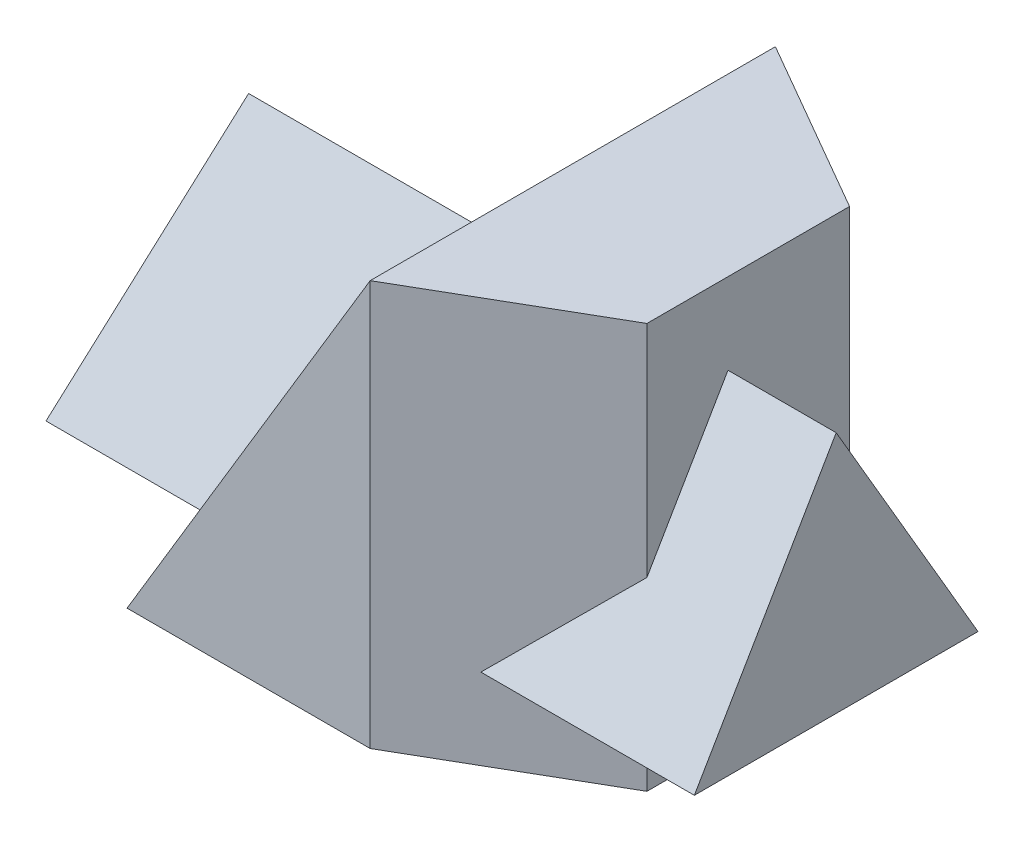
ISO-10303-21;
HEADER;
FILE_DESCRIPTION(('STEP AP214'),'2;1');
FILE_NAME('part.step','',(''),(''),'','','');
FILE_SCHEMA(('AUTOMOTIVE_DESIGN { 1 0 10303 214 1 1 1 1 }'));
ENDSEC;
DATA;
#1=APPLICATION_CONTEXT('core data for automotive mechanical design processes');
#2=APPLICATION_PROTOCOL_DEFINITION('international standard','automotive_design',2000,#1);
#3=PRODUCT_CONTEXT('',#1,'mechanical');
#4=PRODUCT('Part','Part','',(#3));
#5=PRODUCT_RELATED_PRODUCT_CATEGORY('part','',(#4));
#6=PRODUCT_DEFINITION_FORMATION('','',#4);
#7=PRODUCT_DEFINITION_CONTEXT('part definition',#1,'design');
#8=PRODUCT_DEFINITION('design','',#6,#7);
#9=PRODUCT_DEFINITION_SHAPE('','',#8);
#10=(LENGTH_UNIT() NAMED_UNIT(*) SI_UNIT(.MILLI.,.METRE.));
#11=(NAMED_UNIT(*) PLANE_ANGLE_UNIT() SI_UNIT($,.RADIAN.));
#12=(NAMED_UNIT(*) SI_UNIT($,.STERADIAN.) SOLID_ANGLE_UNIT());
#13=UNCERTAINTY_MEASURE_WITH_UNIT(LENGTH_MEASURE(1.E-05),#10,'distance_accuracy_value','');
#14=(GEOMETRIC_REPRESENTATION_CONTEXT(3) GLOBAL_UNCERTAINTY_ASSIGNED_CONTEXT((#13)) GLOBAL_UNIT_ASSIGNED_CONTEXT((#10,
#11,#12)) REPRESENTATION_CONTEXT('',''));
#15=CARTESIAN_POINT('',(0.,0.,0.));
#16=DIRECTION('',(0.,0.,1.));
#17=DIRECTION('',(1.,0.,0.));
#18=AXIS2_PLACEMENT_3D('',#15,#16,#17);
#19=CARTESIAN_POINT('',(60.,100.,0.));
#20=DIRECTION('',(-0.499999999999998,0.,-0.86602540378444));
#21=DIRECTION('',(-0.86602540378444,0.,0.499999999999998));
#22=AXIS2_PLACEMENT_3D('',#19,#20,#21);
#23=PLANE('',#22);
#24=DIRECTION('',(-0.657535505639409,-0.650791373455967,0.379628301182648));
#25=VECTOR('',#24,1.);
#26=CARTESIAN_POINT('',(101.569219381653,43.9999999999998,-23.9999999999999));
#27=LINE('',#26,#25);
#28=CARTESIAN_POINT('',(103.301270189222,45.7142857142855,-24.9999999999999));
#29=VERTEX_POINT('',#28);
#30=CARTESIAN_POINT('',(77.3205080756888,20.,-9.99999999999999));
#31=VERTEX_POINT('',#30);
#32=EDGE_CURVE('E180',#29,#31,#27,.T.);
#33=ORIENTED_EDGE('',*,*,#32,.F.);
#34=DIRECTION('',(0.,-1.,0.));
#35=VECTOR('',#34,1.);
#36=CARTESIAN_POINT('',(103.301270189222,100.,-24.9999999999999));
#37=LINE('',#36,#35);
#38=CARTESIAN_POINT('',(103.301270189222,100.,-24.9999999999999));
#39=VERTEX_POINT('',#38);
#40=EDGE_CURVE('E219',#39,#29,#37,.T.);
#41=ORIENTED_EDGE('',*,*,#40,.F.);
#42=DIRECTION('',(0.86602540378444,0.,-0.499999999999998));
#43=VECTOR('',#42,1.);
#44=CARTESIAN_POINT('',(60.,100.,0.));
#45=LINE('',#44,#43);
#46=CARTESIAN_POINT('',(60.,100.,0.));
#47=VERTEX_POINT('',#46);
#48=EDGE_CURVE('E191',#47,#39,#45,.T.);
#49=ORIENTED_EDGE('',*,*,#48,.F.);
#50=DIRECTION('',(0.,-1.,0.));
#51=VECTOR('',#50,1.);
#52=CARTESIAN_POINT('',(60.,100.,0.));
#53=LINE('',#52,#51);
#54=CARTESIAN_POINT('',(60.,0.,0.));
#55=VERTEX_POINT('',#54);
#56=EDGE_CURVE('E221',#47,#55,#53,.T.);
#57=ORIENTED_EDGE('',*,*,#56,.T.);
#58=DIRECTION('',(0.86602540378444,0.,-0.499999999999998));
#59=VECTOR('',#58,1.);
#60=CARTESIAN_POINT('',(60.,0.,0.));
#61=LINE('',#60,#59);
#62=CARTESIAN_POINT('',(103.301270189222,0.,-24.9999999999999));
#63=VERTEX_POINT('',#62);
#64=EDGE_CURVE('E203',#55,#63,#61,.T.);
#65=ORIENTED_EDGE('',*,*,#64,.T.);
#66=CARTESIAN_POINT('',(103.301270189222,20.,-24.9999999999999));
#67=VERTEX_POINT('',#66);
#68=EDGE_CURVE('E218',#67,#63,#37,.T.);
#69=ORIENTED_EDGE('',*,*,#68,.F.);
#70=DIRECTION('',(0.86602540378444,0.,-0.499999999999998));
#71=VECTOR('',#70,1.);
#72=CARTESIAN_POINT('',(60.,20.,0.));
#73=LINE('',#72,#71);
#74=EDGE_CURVE('E46',#31,#67,#73,.T.);
#75=ORIENTED_EDGE('',*,*,#74,.F.);
#76=EDGE_LOOP('',(#33,#41,#49,#57,#65,#69,#75));
#77=FACE_BOUND('',#76,.T.);
#78=ADVANCED_FACE('F31',(#77),#23,.F.);
#79=CARTESIAN_POINT('',(103.301270189222,100.,-24.9999999999999));
#80=DIRECTION('',(-1.,0.,0.));
#81=DIRECTION('',(0.,0.,1.));
#82=AXIS2_PLACEMENT_3D('',#79,#80,#81);
#83=PLANE('',#82);
#84=DIRECTION('',(0.,0.,-1.));
#85=VECTOR('',#84,1.);
#86=CARTESIAN_POINT('',(103.301270189222,20.,-24.9999999999999));
#87=LINE('',#86,#85);
#88=CARTESIAN_POINT('',(103.301270189222,20.,-75.0000000000001));
#89=VERTEX_POINT('',#88);
#90=EDGE_CURVE('E175',#67,#89,#87,.T.);
#91=ORIENTED_EDGE('',*,*,#90,.F.);
#92=ORIENTED_EDGE('',*,*,#68,.T.);
#93=DIRECTION('',(0.,0.,-1.));
#94=VECTOR('',#93,1.);
#95=CARTESIAN_POINT('',(103.301270189222,0.,-24.9999999999999));
#96=LINE('',#95,#94);
#97=CARTESIAN_POINT('',(103.301270189222,0.,-75.0000000000001));
#98=VERTEX_POINT('',#97);
#99=EDGE_CURVE('E206',#63,#98,#96,.T.);
#100=ORIENTED_EDGE('',*,*,#99,.T.);
#101=DIRECTION('',(0.,-1.,0.));
#102=VECTOR('',#101,1.);
#103=CARTESIAN_POINT('',(103.301270189222,100.,-75.0000000000001));
#104=LINE('',#103,#102);
#105=EDGE_CURVE('E215',#89,#98,#104,.T.);
#106=ORIENTED_EDGE('',*,*,#105,.F.);
#107=EDGE_LOOP('',(#91,#92,#100,#106));
#108=FACE_BOUND('',#107,.T.);
#109=ADVANCED_FACE('F245',(#108),#83,.F.);
#110=DIRECTION('',(0.,-0.863778900898434,0.503871025524086));
#111=VECTOR('',#110,1.);
#112=CARTESIAN_POINT('',(103.301270189222,86.2176165803108,-48.6269430051813));
#113=LINE('',#112,#111);
#114=CARTESIAN_POINT('',(103.301270189222,80.,-45.));
#115=VERTEX_POINT('',#114);
#116=EDGE_CURVE('E54',#115,#29,#113,.T.);
#117=ORIENTED_EDGE('',*,*,#116,.F.);
#118=DIRECTION('',(0.,0.863778900898433,0.503871025524086));
#119=VECTOR('',#118,1.);
#120=CARTESIAN_POINT('',(103.301270189222,103.626943005181,-31.2176165803109));
#121=LINE('',#120,#119);
#122=CARTESIAN_POINT('',(103.301270189222,28.5714285714284,-75.0000000000001));
#123=VERTEX_POINT('',#122);
#124=EDGE_CURVE('E170',#123,#115,#121,.T.);
#125=ORIENTED_EDGE('',*,*,#124,.F.);
#126=CARTESIAN_POINT('',(103.301270189222,100.,-75.0000000000001));
#127=VERTEX_POINT('',#126);
#128=EDGE_CURVE('E216',#127,#123,#104,.T.);
#129=ORIENTED_EDGE('',*,*,#128,.F.);
#130=DIRECTION('',(0.,0.,-1.));
#131=VECTOR('',#130,1.);
#132=CARTESIAN_POINT('',(103.301270189222,100.,-24.9999999999999));
#133=LINE('',#132,#131);
#134=EDGE_CURVE('E193',#39,#127,#133,.T.);
#135=ORIENTED_EDGE('',*,*,#134,.F.);
#136=ORIENTED_EDGE('',*,*,#40,.T.);
#137=EDGE_LOOP('',(#117,#125,#129,#135,#136));
#138=FACE_BOUND('',#137,.T.);
#139=ADVANCED_FACE('F267',(#138),#83,.F.);
#140=CARTESIAN_POINT('',(103.301270189222,100.,-75.0000000000001));
#141=DIRECTION('',(-0.499999999999998,0.,0.86602540378444));
#142=DIRECTION('',(0.86602540378444,0.,0.499999999999998));
#143=AXIS2_PLACEMENT_3D('',#140,#141,#142);
#144=PLANE('',#143);
#145=DIRECTION('',(-0.86602540378444,0.,-0.499999999999998));
#146=VECTOR('',#145,1.);
#147=CARTESIAN_POINT('',(103.301270189222,20.,-75.0000000000001));
#148=LINE('',#147,#146);
#149=CARTESIAN_POINT('',(94.6410161513777,20.,-80.));
#150=VERTEX_POINT('',#149);
#151=EDGE_CURVE('E172',#89,#150,#148,.T.);
#152=ORIENTED_EDGE('',*,*,#151,.F.);
#153=ORIENTED_EDGE('',*,*,#105,.T.);
#154=DIRECTION('',(-0.86602540378444,0.,-0.499999999999998));
#155=VECTOR('',#154,1.);
#156=CARTESIAN_POINT('',(103.301270189222,0.,-75.0000000000001));
#157=LINE('',#156,#155);
#158=CARTESIAN_POINT('',(60.,0.,-100.));
#159=VERTEX_POINT('',#158);
#160=EDGE_CURVE('E209',#98,#159,#157,.T.);
#161=ORIENTED_EDGE('',*,*,#160,.T.);
#162=DIRECTION('',(0.,-1.,0.));
#163=VECTOR('',#162,1.);
#164=CARTESIAN_POINT('',(60.,100.,-100.));
#165=LINE('',#164,#163);
#166=CARTESIAN_POINT('',(60.,100.,-100.));
#167=VERTEX_POINT('',#166);
#168=EDGE_CURVE('E199',#167,#159,#165,.T.);
#169=ORIENTED_EDGE('',*,*,#168,.F.);
#170=DIRECTION('',(-0.86602540378444,0.,-0.499999999999998));
#171=VECTOR('',#170,1.);
#172=CARTESIAN_POINT('',(103.301270189222,100.,-75.0000000000001));
#173=LINE('',#172,#171);
#174=EDGE_CURVE('E196',#127,#167,#173,.T.);
#175=ORIENTED_EDGE('',*,*,#174,.F.);
#176=ORIENTED_EDGE('',*,*,#128,.T.);
#177=DIRECTION('',(0.657535505639409,0.650791373455967,0.379628301182647));
#178=VECTOR('',#177,1.);
#179=CARTESIAN_POINT('',(133.866872675732,58.8235294117644,-57.3529411764708));
#180=LINE('',#179,#178);
#181=EDGE_CURVE('E167',#150,#123,#180,.T.);
#182=ORIENTED_EDGE('',*,*,#181,.F.);
#183=EDGE_LOOP('',(#152,#153,#161,#169,#175,#176,#182));
#184=FACE_BOUND('',#183,.T.);
#185=ADVANCED_FACE('F258',(#184),#144,.F.);
#186=CARTESIAN_POINT('',(60.,100.,-100.));
#187=DIRECTION('',(0.857492925712544,-0.514495755427526,0.));
#188=DIRECTION('',(0.514495755427526,0.857492925712544,0.));
#189=AXIS2_PLACEMENT_3D('',#186,#187,#188);
#190=PLANE('',#189);
#191=DIRECTION('',(0.514495755427526,0.857492925712544,0.));
#192=VECTOR('',#191,1.);
#193=CARTESIAN_POINT('',(60.,100.,0.));
#194=LINE('',#193,#192);
#195=CARTESIAN_POINT('',(0.,0.,0.));
#196=VERTEX_POINT('',#195);
#197=EDGE_CURVE('E182',#196,#47,#194,.T.);
#198=ORIENTED_EDGE('',*,*,#197,.T.);
#199=DIRECTION('',(0.,0.,1.));
#200=VECTOR('',#199,1.);
#201=CARTESIAN_POINT('',(60.,100.,-100.));
#202=LINE('',#201,#200);
#203=EDGE_CURVE('E186',#167,#47,#202,.T.);
#204=ORIENTED_EDGE('',*,*,#203,.F.);
#205=DIRECTION('',(0.514495755427526,0.857492925712544,0.));
#206=VECTOR('',#205,1.);
#207=CARTESIAN_POINT('',(60.,100.,-100.));
#208=LINE('',#207,#206);
#209=CARTESIAN_POINT('',(0.,0.,-100.));
#210=VERTEX_POINT('',#209);
#211=EDGE_CURVE('E183',#210,#167,#208,.T.);
#212=ORIENTED_EDGE('',*,*,#211,.F.);
#213=DIRECTION('',(0.,0.,1.));
#214=VECTOR('',#213,1.);
#215=CARTESIAN_POINT('',(0.,0.,0.));
#216=LINE('',#215,#214);
#217=EDGE_CURVE('E190',#210,#196,#216,.T.);
#218=ORIENTED_EDGE('',*,*,#217,.T.);
#219=EDGE_LOOP('',(#198,#204,#212,#218));
#220=FACE_BOUND('',#219,.T.);
#221=DIRECTION('',(0.460141401592205,0.766902335987008,-0.447359695992421));
#222=VECTOR('',#221,1.);
#223=CARTESIAN_POINT('',(68.9201110929587,114.866851821598,-65.338996895932));
#224=LINE('',#223,#222);
#225=CARTESIAN_POINT('',(12.,20.,-9.99999999999999));
#226=VERTEX_POINT('',#225);
#227=CARTESIAN_POINT('',(48.,80.,-45.));
#228=VERTEX_POINT('',#227);
#229=EDGE_CURVE('E39',#226,#228,#224,.T.);
#230=ORIENTED_EDGE('',*,*,#229,.F.);
#231=DIRECTION('',(0.,0.,1.));
#232=VECTOR('',#231,1.);
#233=CARTESIAN_POINT('',(12.,20.,-100.));
#234=LINE('',#233,#232);
#235=CARTESIAN_POINT('',(12.,20.,-80.));
#236=VERTEX_POINT('',#235);
#237=EDGE_CURVE('E225',#236,#226,#234,.T.);
#238=ORIENTED_EDGE('',*,*,#237,.F.);
#239=DIRECTION('',(-0.460141401592205,-0.766902335987008,-0.447359695992421));
#240=VECTOR('',#239,1.);
#241=CARTESIAN_POINT('',(46.276752164679,77.127920274465,-46.6753798398954));
#242=LINE('',#241,#240);
#243=EDGE_CURVE('E141',#228,#236,#242,.T.);
#244=ORIENTED_EDGE('',*,*,#243,.F.);
#245=EDGE_LOOP('',(#230,#238,#244));
#246=FACE_BOUND('',#245,.T.);
#247=ADVANCED_FACE('F274',(#220,#246),#190,.F.);
#248=CARTESIAN_POINT('',(0.,100.,0.));
#249=DIRECTION('',(0.,0.,-1.));
#250=DIRECTION('',(-1.,0.,0.));
#251=AXIS2_PLACEMENT_3D('',#248,#249,#250);
#252=PLANE('',#251);
#253=ORIENTED_EDGE('',*,*,#56,.F.);
#254=ORIENTED_EDGE('',*,*,#197,.F.);
#255=DIRECTION('',(1.,0.,0.));
#256=VECTOR('',#255,1.);
#257=CARTESIAN_POINT('',(0.,0.,0.));
#258=LINE('',#257,#256);
#259=EDGE_CURVE('E201',#196,#55,#258,.T.);
#260=ORIENTED_EDGE('',*,*,#259,.T.);
#261=EDGE_LOOP('',(#253,#254,#260));
#262=FACE_BOUND('',#261,.T.);
#263=ADVANCED_FACE('F33',(#262),#252,.F.);
#264=CARTESIAN_POINT('',(0.,100.,-100.));
#265=DIRECTION('',(0.,0.,1.));
#266=DIRECTION('',(1.,0.,0.));
#267=AXIS2_PLACEMENT_3D('',#264,#265,#266);
#268=PLANE('',#267);
#269=DIRECTION('',(-1.,0.,0.));
#270=VECTOR('',#269,1.);
#271=CARTESIAN_POINT('',(0.,0.,-100.));
#272=LINE('',#271,#270);
#273=EDGE_CURVE('E194',#159,#210,#272,.T.);
#274=ORIENTED_EDGE('',*,*,#273,.T.);
#275=ORIENTED_EDGE('',*,*,#211,.T.);
#276=ORIENTED_EDGE('',*,*,#168,.T.);
#277=EDGE_LOOP('',(#274,#275,#276));
#278=FACE_BOUND('',#277,.T.);
#279=ADVANCED_FACE('F261',(#278),#268,.F.);
#280=CARTESIAN_POINT('',(0.,100.,-100.));
#281=DIRECTION('',(0.,-1.,0.));
#282=DIRECTION('',(0.,0.,-1.));
#283=AXIS2_PLACEMENT_3D('',#280,#281,#282);
#284=PLANE('',#283);
#285=ORIENTED_EDGE('',*,*,#174,.T.);
#286=ORIENTED_EDGE('',*,*,#203,.T.);
#287=ORIENTED_EDGE('',*,*,#48,.T.);
#288=ORIENTED_EDGE('',*,*,#134,.T.);
#289=EDGE_LOOP('',(#285,#286,#287,#288));
#290=FACE_BOUND('',#289,.T.);
#291=ADVANCED_FACE('F264',(#290),#284,.F.);
#292=CARTESIAN_POINT('',(0.,0.,-100.));
#293=DIRECTION('',(0.,-1.,0.));
#294=DIRECTION('',(0.,0.,-1.));
#295=AXIS2_PLACEMENT_3D('',#292,#293,#294);
#296=PLANE('',#295);
#297=ORIENTED_EDGE('',*,*,#217,.F.);
#298=ORIENTED_EDGE('',*,*,#273,.F.);
#299=ORIENTED_EDGE('',*,*,#160,.F.);
#300=ORIENTED_EDGE('',*,*,#99,.F.);
#301=ORIENTED_EDGE('',*,*,#64,.F.);
#302=ORIENTED_EDGE('',*,*,#259,.F.);
#303=EDGE_LOOP('',(#297,#298,#299,#300,#301,#302));
#304=FACE_BOUND('',#303,.T.);
#305=ADVANCED_FACE('F254',(#304),#296,.T.);
#306=CARTESIAN_POINT('',(130.,80.,-45.));
#307=DIRECTION('',(0.,-0.503871025524086,0.863778900898433));
#308=DIRECTION('',(0.,-0.863778900898433,-0.503871025524086));
#309=AXIS2_PLACEMENT_3D('',#306,#307,#308);
#310=PLANE('',#309);
#311=DIRECTION('',(-1.,0.,0.));
#312=VECTOR('',#311,1.);
#313=CARTESIAN_POINT('',(130.,20.,-80.));
#314=LINE('',#313,#312);
#315=CARTESIAN_POINT('',(-30.,20.,-80.));
#316=VERTEX_POINT('',#315);
#317=EDGE_CURVE('E139',#236,#316,#314,.T.);
#318=ORIENTED_EDGE('',*,*,#317,.T.);
#319=DIRECTION('',(0.211079263419088,0.84431705367635,0.492518281311204));
#320=VECTOR('',#319,1.);
#321=CARTESIAN_POINT('',(-8.53960396039602,105.841584158416,-29.9257425742574));
#322=LINE('',#321,#320);
#323=CARTESIAN_POINT('',(-15.,80.,-45.));
#324=VERTEX_POINT('',#323);
#325=EDGE_CURVE('E128',#316,#324,#322,.T.);
#326=ORIENTED_EDGE('',*,*,#325,.T.);
#327=DIRECTION('',(-1.,0.,0.));
#328=VECTOR('',#327,1.);
#329=CARTESIAN_POINT('',(130.,80.,-45.));
#330=LINE('',#329,#328);
#331=EDGE_CURVE('E161',#228,#324,#330,.T.);
#332=ORIENTED_EDGE('',*,*,#331,.F.);
#333=ORIENTED_EDGE('',*,*,#243,.T.);
#334=EDGE_LOOP('',(#318,#326,#332,#333));
#335=FACE_BOUND('',#334,.T.);
#336=ADVANCED_FACE('F140',(#335),#310,.F.);
#337=CARTESIAN_POINT('',(130.,20.,-80.));
#338=DIRECTION('',(0.,1.,0.));
#339=DIRECTION('',(0.,0.,1.));
#340=AXIS2_PLACEMENT_3D('',#337,#338,#339);
#341=PLANE('',#340);
#342=ORIENTED_EDGE('',*,*,#317,.F.);
#343=ORIENTED_EDGE('',*,*,#237,.T.);
#344=DIRECTION('',(-1.,0.,0.));
#345=VECTOR('',#344,1.);
#346=CARTESIAN_POINT('',(130.,20.,-9.99999999999999));
#347=LINE('',#346,#345);
#348=CARTESIAN_POINT('',(-30.,20.,-9.99999999999999));
#349=VERTEX_POINT('',#348);
#350=EDGE_CURVE('E150',#226,#349,#347,.T.);
#351=ORIENTED_EDGE('',*,*,#350,.T.);
#352=DIRECTION('',(0.,0.,-1.));
#353=VECTOR('',#352,1.);
#354=CARTESIAN_POINT('',(-30.,20.,-80.));
#355=LINE('',#354,#353);
#356=EDGE_CURVE('E132',#349,#316,#355,.T.);
#357=ORIENTED_EDGE('',*,*,#356,.T.);
#358=EDGE_LOOP('',(#342,#343,#351,#357));
#359=FACE_BOUND('',#358,.T.);
#360=ADVANCED_FACE('F148',(#359),#341,.F.);
#361=CARTESIAN_POINT('',(130.,20.,-9.99999999999999));
#362=DIRECTION('',(0.,-0.503871025524086,-0.863778900898433));
#363=DIRECTION('',(0.,0.863778900898434,-0.503871025524086));
#364=AXIS2_PLACEMENT_3D('',#361,#362,#363);
#365=PLANE('',#364);
#366=ORIENTED_EDGE('',*,*,#331,.T.);
#367=DIRECTION('',(-0.211079263419088,-0.84431705367635,0.492518281311204));
#368=VECTOR('',#367,1.);
#369=CARTESIAN_POINT('',(-22.8712871287128,48.5148514851485,-26.6336633663366));
#370=LINE('',#369,#368);
#371=EDGE_CURVE('E11',#324,#349,#370,.T.);
#372=ORIENTED_EDGE('',*,*,#371,.T.);
#373=ORIENTED_EDGE('',*,*,#350,.F.);
#374=ORIENTED_EDGE('',*,*,#229,.T.);
#375=EDGE_LOOP('',(#366,#372,#373,#374));
#376=FACE_BOUND('',#375,.T.);
#377=ADVANCED_FACE('F228',(#376),#365,.F.);
#378=ORIENTED_EDGE('',*,*,#116,.T.);
#379=ORIENTED_EDGE('',*,*,#32,.T.);
#380=CARTESIAN_POINT('',(130.,20.,-9.99999999999999));
#381=VERTEX_POINT('',#380);
#382=EDGE_CURVE('E164',#381,#31,#347,.T.);
#383=ORIENTED_EDGE('',*,*,#382,.F.);
#384=DIRECTION('',(0.,-0.863778900898433,0.503871025524086));
#385=VECTOR('',#384,1.);
#386=CARTESIAN_POINT('',(130.,20.,-9.99999999999999));
#387=LINE('',#386,#385);
#388=CARTESIAN_POINT('',(130.,80.,-45.));
#389=VERTEX_POINT('',#388);
#390=EDGE_CURVE('E151',#389,#381,#387,.T.);
#391=ORIENTED_EDGE('',*,*,#390,.F.);
#392=EDGE_CURVE('E145',#389,#115,#330,.T.);
#393=ORIENTED_EDGE('',*,*,#392,.T.);
#394=EDGE_LOOP('',(#378,#379,#383,#391,#393));
#395=FACE_BOUND('',#394,.T.);
#396=ADVANCED_FACE('F242',(#395),#365,.F.);
#397=ORIENTED_EDGE('',*,*,#382,.T.);
#398=ORIENTED_EDGE('',*,*,#74,.T.);
#399=ORIENTED_EDGE('',*,*,#90,.T.);
#400=ORIENTED_EDGE('',*,*,#151,.T.);
#401=CARTESIAN_POINT('',(130.,20.,-80.));
#402=VERTEX_POINT('',#401);
#403=EDGE_CURVE('E144',#402,#150,#314,.T.);
#404=ORIENTED_EDGE('',*,*,#403,.F.);
#405=DIRECTION('',(0.,0.,-1.));
#406=VECTOR('',#405,1.);
#407=CARTESIAN_POINT('',(130.,20.,-80.));
#408=LINE('',#407,#406);
#409=EDGE_CURVE('E154',#381,#402,#408,.T.);
#410=ORIENTED_EDGE('',*,*,#409,.F.);
#411=EDGE_LOOP('',(#397,#398,#399,#400,#404,#410));
#412=FACE_BOUND('',#411,.T.);
#413=ADVANCED_FACE('F238',(#412),#341,.F.);
#414=ORIENTED_EDGE('',*,*,#181,.T.);
#415=ORIENTED_EDGE('',*,*,#124,.T.);
#416=ORIENTED_EDGE('',*,*,#392,.F.);
#417=DIRECTION('',(0.,0.863778900898433,0.503871025524086));
#418=VECTOR('',#417,1.);
#419=CARTESIAN_POINT('',(130.,80.,-45.));
#420=LINE('',#419,#418);
#421=EDGE_CURVE('E158',#402,#389,#420,.T.);
#422=ORIENTED_EDGE('',*,*,#421,.F.);
#423=ORIENTED_EDGE('',*,*,#403,.T.);
#424=EDGE_LOOP('',(#414,#415,#416,#422,#423));
#425=FACE_BOUND('',#424,.T.);
#426=ADVANCED_FACE('F240',(#425),#310,.F.);
#427=CARTESIAN_POINT('',(130.,80.,-45.));
#428=DIRECTION('',(-1.,0.,0.));
#429=DIRECTION('',(0.,0.,1.));
#430=AXIS2_PLACEMENT_3D('',#427,#428,#429);
#431=PLANE('',#430);
#432=ORIENTED_EDGE('',*,*,#390,.T.);
#433=ORIENTED_EDGE('',*,*,#409,.T.);
#434=ORIENTED_EDGE('',*,*,#421,.T.);
#435=EDGE_LOOP('',(#432,#433,#434));
#436=FACE_BOUND('',#435,.T.);
#437=ADVANCED_FACE('F234',(#436),#431,.F.);
#438=CARTESIAN_POINT('',(-30.,20.,-160.));
#439=DIRECTION('',(0.970142500145332,-0.242535625036333,0.));
#440=DIRECTION('',(0.242535625036333,0.970142500145332,0.));
#441=AXIS2_PLACEMENT_3D('',#438,#439,#440);
#442=PLANE('',#441);
#443=ORIENTED_EDGE('',*,*,#356,.F.);
#444=ORIENTED_EDGE('',*,*,#371,.F.);
#445=ORIENTED_EDGE('',*,*,#325,.F.);
#446=EDGE_LOOP('',(#443,#444,#445));
#447=FACE_BOUND('',#446,.T.);
#448=ADVANCED_FACE('F130',(#447),#442,.F.);
#449=CLOSED_SHELL('',(#78,#109,#139,#185,#247,#263,#279,#291,#305,#336,#360,#377,#396,#413,#426,
#437,#448));
#450=MANIFOLD_SOLID_BREP('B2',#449);
#451=ADVANCED_BREP_SHAPE_REPRESENTATION('',(#18,#450),#14);
#452=SHAPE_DEFINITION_REPRESENTATION(#9,#451);
ENDSEC;
END-ISO-10303-21;
